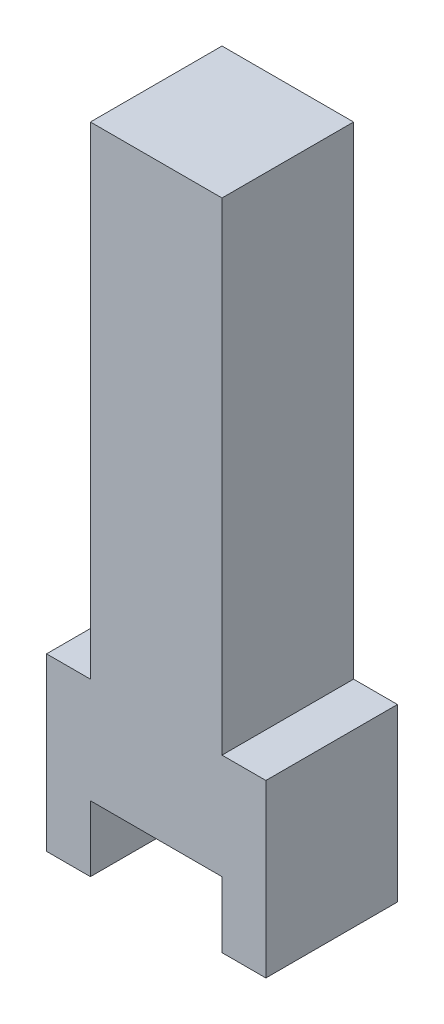
ISO-10303-21;
HEADER;
FILE_DESCRIPTION(('STEP AP214'),'2;1');
FILE_NAME('part.step','',(''),(''),'','','');
FILE_SCHEMA(('AUTOMOTIVE_DESIGN { 1 0 10303 214 1 1 1 1 }'));
ENDSEC;
DATA;
#1=APPLICATION_CONTEXT('core data for automotive mechanical design processes');
#2=APPLICATION_PROTOCOL_DEFINITION('international standard','automotive_design',2000,#1);
#3=PRODUCT_CONTEXT('',#1,'mechanical');
#4=PRODUCT('Part','Part','',(#3));
#5=PRODUCT_RELATED_PRODUCT_CATEGORY('part','',(#4));
#6=PRODUCT_DEFINITION_FORMATION('','',#4);
#7=PRODUCT_DEFINITION_CONTEXT('part definition',#1,'design');
#8=PRODUCT_DEFINITION('design','',#6,#7);
#9=PRODUCT_DEFINITION_SHAPE('','',#8);
#10=(LENGTH_UNIT() NAMED_UNIT(*) SI_UNIT(.MILLI.,.METRE.));
#11=(NAMED_UNIT(*) PLANE_ANGLE_UNIT() SI_UNIT($,.RADIAN.));
#12=(NAMED_UNIT(*) SI_UNIT($,.STERADIAN.) SOLID_ANGLE_UNIT());
#13=UNCERTAINTY_MEASURE_WITH_UNIT(LENGTH_MEASURE(1.E-05),#10,'distance_accuracy_value','');
#14=(GEOMETRIC_REPRESENTATION_CONTEXT(3) GLOBAL_UNCERTAINTY_ASSIGNED_CONTEXT((#13)) GLOBAL_UNIT_ASSIGNED_CONTEXT((#10,
#11,#12)) REPRESENTATION_CONTEXT('',''));
#15=CARTESIAN_POINT('',(0.,0.,0.));
#16=DIRECTION('',(0.,0.,1.));
#17=DIRECTION('',(1.,0.,0.));
#18=AXIS2_PLACEMENT_3D('',#15,#16,#17);
#19=CARTESIAN_POINT('',(0.,0.,3.));
#20=DIRECTION('',(1.,0.,0.));
#21=DIRECTION('',(0.,1.,0.));
#22=AXIS2_PLACEMENT_3D('',#19,#20,#21);
#23=PLANE('',#22);
#24=DIRECTION('',(0.,-1.,0.));
#25=VECTOR('',#24,1.);
#26=CARTESIAN_POINT('',(0.,0.,0.));
#27=LINE('',#26,#25);
#28=CARTESIAN_POINT('',(0.,0.,0.));
#29=VERTEX_POINT('',#28);
#30=CARTESIAN_POINT('',(0.,-3.9,0.));
#31=VERTEX_POINT('',#30);
#32=EDGE_CURVE('E153',#29,#31,#27,.T.);
#33=ORIENTED_EDGE('',*,*,#32,.T.);
#34=DIRECTION('',(0.,0.,-1.));
#35=VECTOR('',#34,1.);
#36=CARTESIAN_POINT('',(0.,-3.9,3.));
#37=LINE('',#36,#35);
#38=CARTESIAN_POINT('',(0.,-3.9,3.));
#39=VERTEX_POINT('',#38);
#40=EDGE_CURVE('E11',#39,#31,#37,.T.);
#41=ORIENTED_EDGE('',*,*,#40,.F.);
#42=DIRECTION('',(0.,-1.,0.));
#43=VECTOR('',#42,1.);
#44=CARTESIAN_POINT('',(0.,0.,3.));
#45=LINE('',#44,#43);
#46=CARTESIAN_POINT('',(0.,0.,3.));
#47=VERTEX_POINT('',#46);
#48=EDGE_CURVE('E175',#47,#39,#45,.T.);
#49=ORIENTED_EDGE('',*,*,#48,.F.);
#50=DIRECTION('',(0.,0.,-1.));
#51=VECTOR('',#50,1.);
#52=CARTESIAN_POINT('',(0.,0.,3.));
#53=LINE('',#52,#51);
#54=EDGE_CURVE('E149',#47,#29,#53,.T.);
#55=ORIENTED_EDGE('',*,*,#54,.T.);
#56=EDGE_LOOP('',(#33,#41,#49,#55));
#57=FACE_BOUND('',#56,.T.);
#58=ADVANCED_FACE('F33',(#57),#23,.F.);
#59=CARTESIAN_POINT('',(0.,-3.9,3.));
#60=DIRECTION('',(0.,1.,0.));
#61=DIRECTION('',(0.,0.,1.));
#62=AXIS2_PLACEMENT_3D('',#59,#60,#61);
#63=PLANE('',#62);
#64=DIRECTION('',(1.,0.,0.));
#65=VECTOR('',#64,1.);
#66=CARTESIAN_POINT('',(0.,-3.9,0.));
#67=LINE('',#66,#65);
#68=CARTESIAN_POINT('',(1.,-3.9,0.));
#69=VERTEX_POINT('',#68);
#70=EDGE_CURVE('E156',#31,#69,#67,.T.);
#71=ORIENTED_EDGE('',*,*,#70,.T.);
#72=DIRECTION('',(0.,0.,-1.));
#73=VECTOR('',#72,1.);
#74=CARTESIAN_POINT('',(1.,-3.9,3.));
#75=LINE('',#74,#73);
#76=CARTESIAN_POINT('',(1.,-3.9,3.));
#77=VERTEX_POINT('',#76);
#78=EDGE_CURVE('E41',#77,#69,#75,.T.);
#79=ORIENTED_EDGE('',*,*,#78,.F.);
#80=DIRECTION('',(1.,0.,0.));
#81=VECTOR('',#80,1.);
#82=CARTESIAN_POINT('',(0.,-3.9,3.));
#83=LINE('',#82,#81);
#84=EDGE_CURVE('E104',#39,#77,#83,.T.);
#85=ORIENTED_EDGE('',*,*,#84,.F.);
#86=ORIENTED_EDGE('',*,*,#40,.T.);
#87=EDGE_LOOP('',(#71,#79,#85,#86));
#88=FACE_BOUND('',#87,.T.);
#89=ADVANCED_FACE('F253',(#88),#63,.F.);
#90=CARTESIAN_POINT('',(1.,-2.4,3.));
#91=DIRECTION('',(-1.,0.,0.));
#92=DIRECTION('',(0.,-1.,0.));
#93=AXIS2_PLACEMENT_3D('',#90,#91,#92);
#94=PLANE('',#93);
#95=DIRECTION('',(0.,1.,0.));
#96=VECTOR('',#95,1.);
#97=CARTESIAN_POINT('',(1.,-2.4,0.));
#98=LINE('',#97,#96);
#99=CARTESIAN_POINT('',(1.,-2.4,0.));
#100=VERTEX_POINT('',#99);
#101=EDGE_CURVE('E158',#69,#100,#98,.T.);
#102=ORIENTED_EDGE('',*,*,#101,.T.);
#103=DIRECTION('',(0.,0.,-1.));
#104=VECTOR('',#103,1.);
#105=CARTESIAN_POINT('',(1.,-2.4,3.));
#106=LINE('',#105,#104);
#107=CARTESIAN_POINT('',(1.,-2.4,3.));
#108=VERTEX_POINT('',#107);
#109=EDGE_CURVE('E194',#108,#100,#106,.T.);
#110=ORIENTED_EDGE('',*,*,#109,.F.);
#111=DIRECTION('',(0.,1.,0.));
#112=VECTOR('',#111,1.);
#113=CARTESIAN_POINT('',(1.,-2.4,3.));
#114=LINE('',#113,#112);
#115=EDGE_CURVE('E202',#77,#108,#114,.T.);
#116=ORIENTED_EDGE('',*,*,#115,.F.);
#117=ORIENTED_EDGE('',*,*,#78,.T.);
#118=EDGE_LOOP('',(#102,#110,#116,#117));
#119=FACE_BOUND('',#118,.T.);
#120=ADVANCED_FACE('F200',(#119),#94,.F.);
#121=CARTESIAN_POINT('',(1.,-2.4,3.));
#122=DIRECTION('',(0.,1.,0.));
#123=DIRECTION('',(0.,0.,1.));
#124=AXIS2_PLACEMENT_3D('',#121,#122,#123);
#125=PLANE('',#124);
#126=DIRECTION('',(1.,0.,0.));
#127=VECTOR('',#126,1.);
#128=CARTESIAN_POINT('',(1.,-2.4,0.));
#129=LINE('',#128,#127);
#130=CARTESIAN_POINT('',(4.,-2.4,0.));
#131=VERTEX_POINT('',#130);
#132=EDGE_CURVE('E160',#100,#131,#129,.T.);
#133=ORIENTED_EDGE('',*,*,#132,.T.);
#134=DIRECTION('',(0.,0.,-1.));
#135=VECTOR('',#134,1.);
#136=CARTESIAN_POINT('',(4.,-2.4,3.));
#137=LINE('',#136,#135);
#138=CARTESIAN_POINT('',(4.,-2.4,3.));
#139=VERTEX_POINT('',#138);
#140=EDGE_CURVE('E191',#139,#131,#137,.T.);
#141=ORIENTED_EDGE('',*,*,#140,.F.);
#142=DIRECTION('',(1.,0.,0.));
#143=VECTOR('',#142,1.);
#144=CARTESIAN_POINT('',(1.,-2.4,3.));
#145=LINE('',#144,#143);
#146=EDGE_CURVE('E220',#108,#139,#145,.T.);
#147=ORIENTED_EDGE('',*,*,#146,.F.);
#148=ORIENTED_EDGE('',*,*,#109,.T.);
#149=EDGE_LOOP('',(#133,#141,#147,#148));
#150=FACE_BOUND('',#149,.T.);
#151=ADVANCED_FACE('F211',(#150),#125,.F.);
#152=CARTESIAN_POINT('',(4.,-2.4,3.));
#153=DIRECTION('',(1.,0.,0.));
#154=DIRECTION('',(0.,0.,-1.));
#155=AXIS2_PLACEMENT_3D('',#152,#153,#154);
#156=PLANE('',#155);
#157=DIRECTION('',(0.,-1.,0.));
#158=VECTOR('',#157,1.);
#159=CARTESIAN_POINT('',(4.,-2.4,0.));
#160=LINE('',#159,#158);
#161=CARTESIAN_POINT('',(4.,-3.9,0.));
#162=VERTEX_POINT('',#161);
#163=EDGE_CURVE('E162',#131,#162,#160,.T.);
#164=ORIENTED_EDGE('',*,*,#163,.T.);
#165=DIRECTION('',(0.,0.,-1.));
#166=VECTOR('',#165,1.);
#167=CARTESIAN_POINT('',(4.,-3.9,3.));
#168=LINE('',#167,#166);
#169=CARTESIAN_POINT('',(4.,-3.9,3.));
#170=VERTEX_POINT('',#169);
#171=EDGE_CURVE('E188',#170,#162,#168,.T.);
#172=ORIENTED_EDGE('',*,*,#171,.F.);
#173=DIRECTION('',(0.,-1.,0.));
#174=VECTOR('',#173,1.);
#175=CARTESIAN_POINT('',(4.,-2.4,3.));
#176=LINE('',#175,#174);
#177=EDGE_CURVE('E217',#139,#170,#176,.T.);
#178=ORIENTED_EDGE('',*,*,#177,.F.);
#179=ORIENTED_EDGE('',*,*,#140,.T.);
#180=EDGE_LOOP('',(#164,#172,#178,#179));
#181=FACE_BOUND('',#180,.T.);
#182=ADVANCED_FACE('F215',(#181),#156,.F.);
#183=CARTESIAN_POINT('',(4.,-3.9,3.));
#184=DIRECTION('',(0.,1.,0.));
#185=DIRECTION('',(0.,0.,1.));
#186=AXIS2_PLACEMENT_3D('',#183,#184,#185);
#187=PLANE('',#186);
#188=DIRECTION('',(1.,0.,0.));
#189=VECTOR('',#188,1.);
#190=CARTESIAN_POINT('',(4.,-3.9,0.));
#191=LINE('',#190,#189);
#192=CARTESIAN_POINT('',(5.,-3.9,0.));
#193=VERTEX_POINT('',#192);
#194=EDGE_CURVE('E164',#162,#193,#191,.T.);
#195=ORIENTED_EDGE('',*,*,#194,.T.);
#196=DIRECTION('',(0.,0.,-1.));
#197=VECTOR('',#196,1.);
#198=CARTESIAN_POINT('',(5.,-3.9,3.));
#199=LINE('',#198,#197);
#200=CARTESIAN_POINT('',(5.,-3.9,3.));
#201=VERTEX_POINT('',#200);
#202=EDGE_CURVE('E185',#201,#193,#199,.T.);
#203=ORIENTED_EDGE('',*,*,#202,.F.);
#204=DIRECTION('',(1.,0.,0.));
#205=VECTOR('',#204,1.);
#206=CARTESIAN_POINT('',(4.,-3.9,3.));
#207=LINE('',#206,#205);
#208=EDGE_CURVE('E219',#170,#201,#207,.T.);
#209=ORIENTED_EDGE('',*,*,#208,.F.);
#210=ORIENTED_EDGE('',*,*,#171,.T.);
#211=EDGE_LOOP('',(#195,#203,#209,#210));
#212=FACE_BOUND('',#211,.T.);
#213=ADVANCED_FACE('F266',(#212),#187,.F.);
#214=CARTESIAN_POINT('',(5.,0.,3.));
#215=DIRECTION('',(-1.,0.,0.));
#216=DIRECTION('',(0.,-1.,0.));
#217=AXIS2_PLACEMENT_3D('',#214,#215,#216);
#218=PLANE('',#217);
#219=DIRECTION('',(0.,1.,0.));
#220=VECTOR('',#219,1.);
#221=CARTESIAN_POINT('',(5.,0.,0.));
#222=LINE('',#221,#220);
#223=CARTESIAN_POINT('',(5.,0.,0.));
#224=VERTEX_POINT('',#223);
#225=EDGE_CURVE('E166',#193,#224,#222,.T.);
#226=ORIENTED_EDGE('',*,*,#225,.T.);
#227=DIRECTION('',(0.,0.,-1.));
#228=VECTOR('',#227,1.);
#229=CARTESIAN_POINT('',(5.,0.,3.));
#230=LINE('',#229,#228);
#231=CARTESIAN_POINT('',(5.,0.,3.));
#232=VERTEX_POINT('',#231);
#233=EDGE_CURVE('E182',#232,#224,#230,.T.);
#234=ORIENTED_EDGE('',*,*,#233,.F.);
#235=DIRECTION('',(0.,1.,0.));
#236=VECTOR('',#235,1.);
#237=CARTESIAN_POINT('',(5.,0.,3.));
#238=LINE('',#237,#236);
#239=EDGE_CURVE('E222',#201,#232,#238,.T.);
#240=ORIENTED_EDGE('',*,*,#239,.F.);
#241=ORIENTED_EDGE('',*,*,#202,.T.);
#242=EDGE_LOOP('',(#226,#234,#240,#241));
#243=FACE_BOUND('',#242,.T.);
#244=ADVANCED_FACE('F269',(#243),#218,.F.);
#245=CARTESIAN_POINT('',(4.,0.,3.));
#246=DIRECTION('',(0.,-1.,0.));
#247=DIRECTION('',(0.,0.,-1.));
#248=AXIS2_PLACEMENT_3D('',#245,#246,#247);
#249=PLANE('',#248);
#250=DIRECTION('',(-1.,0.,0.));
#251=VECTOR('',#250,1.);
#252=CARTESIAN_POINT('',(4.,0.,0.));
#253=LINE('',#252,#251);
#254=CARTESIAN_POINT('',(4.,0.,0.));
#255=VERTEX_POINT('',#254);
#256=EDGE_CURVE('E168',#224,#255,#253,.T.);
#257=ORIENTED_EDGE('',*,*,#256,.T.);
#258=DIRECTION('',(0.,0.,-1.));
#259=VECTOR('',#258,1.);
#260=CARTESIAN_POINT('',(4.,0.,3.));
#261=LINE('',#260,#259);
#262=CARTESIAN_POINT('',(4.,0.,3.));
#263=VERTEX_POINT('',#262);
#264=EDGE_CURVE('E179',#263,#255,#261,.T.);
#265=ORIENTED_EDGE('',*,*,#264,.F.);
#266=DIRECTION('',(-1.,0.,0.));
#267=VECTOR('',#266,1.);
#268=CARTESIAN_POINT('',(4.,0.,3.));
#269=LINE('',#268,#267);
#270=EDGE_CURVE('E228',#232,#263,#269,.T.);
#271=ORIENTED_EDGE('',*,*,#270,.F.);
#272=ORIENTED_EDGE('',*,*,#233,.T.);
#273=EDGE_LOOP('',(#257,#265,#271,#272));
#274=FACE_BOUND('',#273,.T.);
#275=ADVANCED_FACE('F234',(#274),#249,.F.);
#276=CARTESIAN_POINT('',(4.,11.,3.));
#277=DIRECTION('',(-1.,0.,0.));
#278=DIRECTION('',(0.,-1.,0.));
#279=AXIS2_PLACEMENT_3D('',#276,#277,#278);
#280=PLANE('',#279);
#281=DIRECTION('',(0.,1.,0.));
#282=VECTOR('',#281,1.);
#283=CARTESIAN_POINT('',(4.,11.,0.));
#284=LINE('',#283,#282);
#285=CARTESIAN_POINT('',(4.,11.,0.));
#286=VERTEX_POINT('',#285);
#287=EDGE_CURVE('E170',#255,#286,#284,.T.);
#288=ORIENTED_EDGE('',*,*,#287,.T.);
#289=DIRECTION('',(0.,0.,-1.));
#290=VECTOR('',#289,1.);
#291=CARTESIAN_POINT('',(4.,11.,3.));
#292=LINE('',#291,#290);
#293=CARTESIAN_POINT('',(4.,11.,3.));
#294=VERTEX_POINT('',#293);
#295=EDGE_CURVE('E144',#294,#286,#292,.T.);
#296=ORIENTED_EDGE('',*,*,#295,.F.);
#297=DIRECTION('',(0.,1.,0.));
#298=VECTOR('',#297,1.);
#299=CARTESIAN_POINT('',(4.,11.,3.));
#300=LINE('',#299,#298);
#301=EDGE_CURVE('E135',#263,#294,#300,.T.);
#302=ORIENTED_EDGE('',*,*,#301,.F.);
#303=ORIENTED_EDGE('',*,*,#264,.T.);
#304=EDGE_LOOP('',(#288,#296,#302,#303));
#305=FACE_BOUND('',#304,.T.);
#306=ADVANCED_FACE('F238',(#305),#280,.F.);
#307=CARTESIAN_POINT('',(0.999999999999999,11.,3.));
#308=DIRECTION('',(0.,-1.,0.));
#309=DIRECTION('',(0.,0.,-1.));
#310=AXIS2_PLACEMENT_3D('',#307,#308,#309);
#311=PLANE('',#310);
#312=DIRECTION('',(-1.,0.,0.));
#313=VECTOR('',#312,1.);
#314=CARTESIAN_POINT('',(0.999999999999999,11.,0.));
#315=LINE('',#314,#313);
#316=CARTESIAN_POINT('',(0.999999999999999,11.,0.));
#317=VERTEX_POINT('',#316);
#318=EDGE_CURVE('E143',#286,#317,#315,.T.);
#319=ORIENTED_EDGE('',*,*,#318,.T.);
#320=DIRECTION('',(0.,0.,-1.));
#321=VECTOR('',#320,1.);
#322=CARTESIAN_POINT('',(0.999999999999999,11.,3.));
#323=LINE('',#322,#321);
#324=CARTESIAN_POINT('',(0.999999999999999,11.,3.));
#325=VERTEX_POINT('',#324);
#326=EDGE_CURVE('E140',#325,#317,#323,.T.);
#327=ORIENTED_EDGE('',*,*,#326,.F.);
#328=DIRECTION('',(-1.,0.,0.));
#329=VECTOR('',#328,1.);
#330=CARTESIAN_POINT('',(0.999999999999999,11.,3.));
#331=LINE('',#330,#329);
#332=EDGE_CURVE('E129',#294,#325,#331,.T.);
#333=ORIENTED_EDGE('',*,*,#332,.F.);
#334=ORIENTED_EDGE('',*,*,#295,.T.);
#335=EDGE_LOOP('',(#319,#327,#333,#334));
#336=FACE_BOUND('',#335,.T.);
#337=ADVANCED_FACE('F141',(#336),#311,.F.);
#338=CARTESIAN_POINT('',(0.999999999999999,11.,3.));
#339=DIRECTION('',(1.,0.,0.));
#340=DIRECTION('',(0.,1.,0.));
#341=AXIS2_PLACEMENT_3D('',#338,#339,#340);
#342=PLANE('',#341);
#343=DIRECTION('',(0.,-1.,0.));
#344=VECTOR('',#343,1.);
#345=CARTESIAN_POINT('',(0.999999999999999,11.,0.));
#346=LINE('',#345,#344);
#347=CARTESIAN_POINT('',(1.,0.,0.));
#348=VERTEX_POINT('',#347);
#349=EDGE_CURVE('E90',#317,#348,#346,.T.);
#350=ORIENTED_EDGE('',*,*,#349,.T.);
#351=DIRECTION('',(0.,0.,-1.));
#352=VECTOR('',#351,1.);
#353=CARTESIAN_POINT('',(1.,0.,3.));
#354=LINE('',#353,#352);
#355=CARTESIAN_POINT('',(1.,0.,3.));
#356=VERTEX_POINT('',#355);
#357=EDGE_CURVE('E145',#356,#348,#354,.T.);
#358=ORIENTED_EDGE('',*,*,#357,.F.);
#359=DIRECTION('',(0.,-1.,0.));
#360=VECTOR('',#359,1.);
#361=CARTESIAN_POINT('',(0.999999999999999,11.,3.));
#362=LINE('',#361,#360);
#363=EDGE_CURVE('E133',#325,#356,#362,.T.);
#364=ORIENTED_EDGE('',*,*,#363,.F.);
#365=ORIENTED_EDGE('',*,*,#326,.T.);
#366=EDGE_LOOP('',(#350,#358,#364,#365));
#367=FACE_BOUND('',#366,.T.);
#368=ADVANCED_FACE('F147',(#367),#342,.F.);
#369=CARTESIAN_POINT('',(0.,0.,3.));
#370=DIRECTION('',(0.,-1.,0.));
#371=DIRECTION('',(1.,0.,0.));
#372=AXIS2_PLACEMENT_3D('',#369,#370,#371);
#373=PLANE('',#372);
#374=DIRECTION('',(-1.,0.,0.));
#375=VECTOR('',#374,1.);
#376=CARTESIAN_POINT('',(0.,0.,0.));
#377=LINE('',#376,#375);
#378=EDGE_CURVE('E96',#348,#29,#377,.T.);
#379=ORIENTED_EDGE('',*,*,#378,.T.);
#380=ORIENTED_EDGE('',*,*,#54,.F.);
#381=DIRECTION('',(-1.,0.,0.));
#382=VECTOR('',#381,1.);
#383=CARTESIAN_POINT('',(0.,0.,3.));
#384=LINE('',#383,#382);
#385=EDGE_CURVE('E49',#356,#47,#384,.T.);
#386=ORIENTED_EDGE('',*,*,#385,.F.);
#387=ORIENTED_EDGE('',*,*,#357,.T.);
#388=EDGE_LOOP('',(#379,#380,#386,#387));
#389=FACE_BOUND('',#388,.T.);
#390=ADVANCED_FACE('F242',(#389),#373,.F.);
#391=CARTESIAN_POINT('',(0.,0.,3.));
#392=DIRECTION('',(0.,0.,1.));
#393=DIRECTION('',(1.,0.,0.));
#394=AXIS2_PLACEMENT_3D('',#391,#392,#393);
#395=PLANE('',#394);
#396=ORIENTED_EDGE('',*,*,#48,.T.);
#397=ORIENTED_EDGE('',*,*,#84,.T.);
#398=ORIENTED_EDGE('',*,*,#115,.T.);
#399=ORIENTED_EDGE('',*,*,#146,.T.);
#400=ORIENTED_EDGE('',*,*,#177,.T.);
#401=ORIENTED_EDGE('',*,*,#208,.T.);
#402=ORIENTED_EDGE('',*,*,#239,.T.);
#403=ORIENTED_EDGE('',*,*,#270,.T.);
#404=ORIENTED_EDGE('',*,*,#301,.T.);
#405=ORIENTED_EDGE('',*,*,#332,.T.);
#406=ORIENTED_EDGE('',*,*,#363,.T.);
#407=ORIENTED_EDGE('',*,*,#385,.T.);
#408=EDGE_LOOP('',(#396,#397,#398,#399,#400,#401,#402,#403,#404,#405,#406,#407));
#409=FACE_BOUND('',#408,.T.);
#410=ADVANCED_FACE('F131',(#409),#395,.T.);
#411=CARTESIAN_POINT('',(0.,0.,0.));
#412=DIRECTION('',(0.,0.,1.));
#413=DIRECTION('',(1.,0.,0.));
#414=AXIS2_PLACEMENT_3D('',#411,#412,#413);
#415=PLANE('',#414);
#416=ORIENTED_EDGE('',*,*,#32,.F.);
#417=ORIENTED_EDGE('',*,*,#378,.F.);
#418=ORIENTED_EDGE('',*,*,#349,.F.);
#419=ORIENTED_EDGE('',*,*,#318,.F.);
#420=ORIENTED_EDGE('',*,*,#287,.F.);
#421=ORIENTED_EDGE('',*,*,#256,.F.);
#422=ORIENTED_EDGE('',*,*,#225,.F.);
#423=ORIENTED_EDGE('',*,*,#194,.F.);
#424=ORIENTED_EDGE('',*,*,#163,.F.);
#425=ORIENTED_EDGE('',*,*,#132,.F.);
#426=ORIENTED_EDGE('',*,*,#101,.F.);
#427=ORIENTED_EDGE('',*,*,#70,.F.);
#428=EDGE_LOOP('',(#416,#417,#418,#419,#420,#421,#422,#423,#424,#425,#426,#427));
#429=FACE_BOUND('',#428,.T.);
#430=ADVANCED_FACE('F206',(#429),#415,.F.);
#431=CLOSED_SHELL('',(#58,#89,#120,#151,#182,#213,#244,#275,#306,#337,#368,#390,#410,#430));
#432=MANIFOLD_SOLID_BREP('B2',#431);
#433=ADVANCED_BREP_SHAPE_REPRESENTATION('',(#18,#432),#14);
#434=SHAPE_DEFINITION_REPRESENTATION(#9,#433);
ENDSEC;
END-ISO-10303-21;
